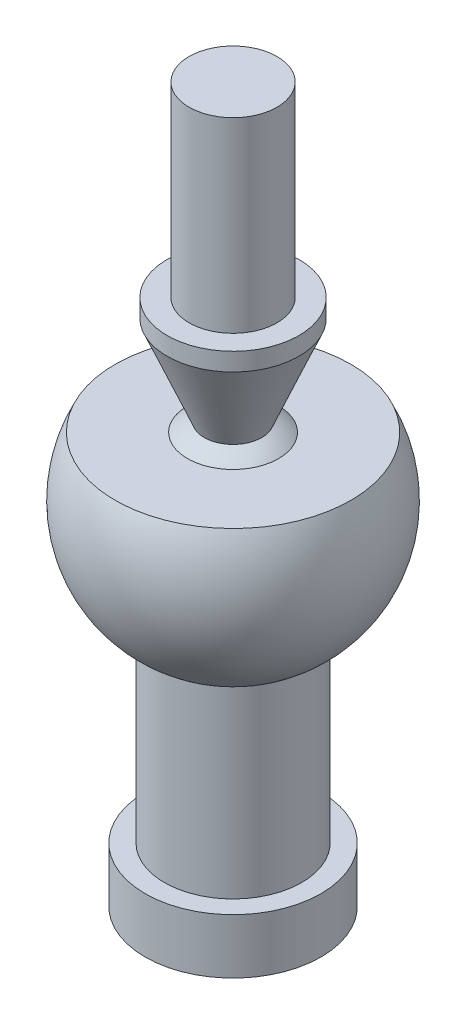
ISO-10303-21;
HEADER;
FILE_DESCRIPTION(('STEP AP214'),'2;1');
FILE_NAME('part.step','',(''),(''),'','','');
FILE_SCHEMA(('AUTOMOTIVE_DESIGN { 1 0 10303 214 1 1 1 1 }'));
ENDSEC;
DATA;
#1=APPLICATION_CONTEXT('core data for automotive mechanical design processes');
#2=APPLICATION_PROTOCOL_DEFINITION('international standard','automotive_design',2000,#1);
#3=PRODUCT_CONTEXT('',#1,'mechanical');
#4=PRODUCT('Part','Part','',(#3));
#5=PRODUCT_RELATED_PRODUCT_CATEGORY('part','',(#4));
#6=PRODUCT_DEFINITION_FORMATION('','',#4);
#7=PRODUCT_DEFINITION_CONTEXT('part definition',#1,'design');
#8=PRODUCT_DEFINITION('design','',#6,#7);
#9=PRODUCT_DEFINITION_SHAPE('','',#8);
#10=(LENGTH_UNIT() NAMED_UNIT(*) SI_UNIT(.MILLI.,.METRE.));
#11=(NAMED_UNIT(*) PLANE_ANGLE_UNIT() SI_UNIT($,.RADIAN.));
#12=(NAMED_UNIT(*) SI_UNIT($,.STERADIAN.) SOLID_ANGLE_UNIT());
#13=UNCERTAINTY_MEASURE_WITH_UNIT(LENGTH_MEASURE(1.E-05),#10,'distance_accuracy_value','');
#14=(GEOMETRIC_REPRESENTATION_CONTEXT(3) GLOBAL_UNCERTAINTY_ASSIGNED_CONTEXT((#13)) GLOBAL_UNIT_ASSIGNED_CONTEXT((#10,
#11,#12)) REPRESENTATION_CONTEXT('',''));
#15=CARTESIAN_POINT('',(0.,0.,0.));
#16=DIRECTION('',(0.,0.,1.));
#17=DIRECTION('',(1.,0.,0.));
#18=AXIS2_PLACEMENT_3D('',#15,#16,#17);
#19=CARTESIAN_POINT('',(0.,12.0381276017463,0.));
#20=DIRECTION('',(0.,-1.,0.));
#21=DIRECTION('',(0.,0.,-1.));
#22=AXIS2_PLACEMENT_3D('',#19,#20,#21);
#23=CONICAL_SURFACE('',#22,0.,1.04719755119659);
#24=CARTESIAN_POINT('',(0.,9.72872652498777,0.));
#25=DIRECTION('',(0.,-1.,0.));
#26=DIRECTION('',(0.,0.,-1.));
#27=AXIS2_PLACEMENT_3D('',#24,#25,#26);
#28=CIRCLE('',#27,4.);
#29=CARTESIAN_POINT('',(0.,9.72872652498777,-4.));
#30=VERTEX_POINT('',#29);
#31=EDGE_CURVE('E11',#30,#30,#28,.T.);
#32=ORIENTED_EDGE('',*,*,#31,.T.);
#33=EDGE_LOOP('',(#32));
#34=FACE_BOUND('',#33,.T.);
#35=CARTESIAN_POINT('',(0.,12.0381276017463,0.));
#36=VERTEX_POINT('',#35);
#37=VERTEX_LOOP('',#36);
#38=FACE_BOUND('',#37,.T.);
#39=ADVANCED_FACE('F34',(#34,#38),#23,.F.);
#40=CARTESIAN_POINT('',(0.,0.112242194172495,0.));
#41=DIRECTION('',(0.,-1.,0.));
#42=DIRECTION('',(0.,0.,-1.));
#43=AXIS2_PLACEMENT_3D('',#40,#41,#42);
#44=CYLINDRICAL_SURFACE('',#43,4.);
#45=CARTESIAN_POINT('',(0.,0.,0.));
#46=DIRECTION('',(0.,-1.,0.));
#47=DIRECTION('',(0.,0.,-1.));
#48=AXIS2_PLACEMENT_3D('',#45,#46,#47);
#49=CIRCLE('',#48,4.);
#50=CARTESIAN_POINT('',(0.,0.,-4.));
#51=VERTEX_POINT('',#50);
#52=EDGE_CURVE('E40',#51,#51,#49,.T.);
#53=ORIENTED_EDGE('',*,*,#52,.T.);
#54=EDGE_LOOP('',(#53));
#55=FACE_BOUND('',#54,.T.);
#56=ORIENTED_EDGE('',*,*,#31,.F.);
#57=EDGE_LOOP('',(#56));
#58=FACE_BOUND('',#57,.T.);
#59=ADVANCED_FACE('F44',(#55,#58),#44,.F.);
#60=CARTESIAN_POINT('',(4.,0.,0.));
#61=DIRECTION('',(0.,-1.,0.));
#62=DIRECTION('',(0.,0.,-1.));
#63=AXIS2_PLACEMENT_3D('',#60,#61,#62);
#64=PLANE('',#63);
#65=CARTESIAN_POINT('',(0.,0.,0.));
#66=DIRECTION('',(0.,-1.,0.));
#67=DIRECTION('',(0.,0.,-1.));
#68=AXIS2_PLACEMENT_3D('',#65,#66,#67);
#69=CIRCLE('',#68,8.);
#70=CARTESIAN_POINT('',(0.,0.,-8.));
#71=VERTEX_POINT('',#70);
#72=EDGE_CURVE('E137',#71,#71,#69,.T.);
#73=ORIENTED_EDGE('',*,*,#72,.T.);
#74=EDGE_LOOP('',(#73));
#75=FACE_BOUND('',#74,.T.);
#76=ORIENTED_EDGE('',*,*,#52,.F.);
#77=EDGE_LOOP('',(#76));
#78=FACE_BOUND('',#77,.T.);
#79=ADVANCED_FACE('F49',(#75,#78),#64,.T.);
#80=CARTESIAN_POINT('',(0.,0.112242194172495,0.));
#81=DIRECTION('',(0.,-1.,0.));
#82=DIRECTION('',(0.,0.,-1.));
#83=AXIS2_PLACEMENT_3D('',#80,#81,#82);
#84=CYLINDRICAL_SURFACE('',#83,8.);
#85=CARTESIAN_POINT('',(0.,5.,0.));
#86=DIRECTION('',(0.,-1.,0.));
#87=DIRECTION('',(0.,0.,-1.));
#88=AXIS2_PLACEMENT_3D('',#85,#86,#87);
#89=CIRCLE('',#88,8.);
#90=CARTESIAN_POINT('',(0.,5.,-8.));
#91=VERTEX_POINT('',#90);
#92=EDGE_CURVE('E134',#91,#91,#89,.T.);
#93=ORIENTED_EDGE('',*,*,#92,.T.);
#94=EDGE_LOOP('',(#93));
#95=FACE_BOUND('',#94,.T.);
#96=ORIENTED_EDGE('',*,*,#72,.F.);
#97=EDGE_LOOP('',(#96));
#98=FACE_BOUND('',#97,.T.);
#99=ADVANCED_FACE('F56',(#95,#98),#84,.T.);
#100=CARTESIAN_POINT('',(8.,5.,0.));
#101=DIRECTION('',(0.,1.,0.));
#102=DIRECTION('',(0.,0.,1.));
#103=AXIS2_PLACEMENT_3D('',#100,#101,#102);
#104=PLANE('',#103);
#105=CARTESIAN_POINT('',(0.,5.,0.));
#106=DIRECTION('',(0.,-1.,0.));
#107=DIRECTION('',(0.,0.,-1.));
#108=AXIS2_PLACEMENT_3D('',#105,#106,#107);
#109=CIRCLE('',#108,6.25);
#110=CARTESIAN_POINT('',(0.,5.,-6.25));
#111=VERTEX_POINT('',#110);
#112=EDGE_CURVE('E131',#111,#111,#109,.T.);
#113=ORIENTED_EDGE('',*,*,#112,.T.);
#114=EDGE_LOOP('',(#113));
#115=FACE_BOUND('',#114,.T.);
#116=ORIENTED_EDGE('',*,*,#92,.F.);
#117=EDGE_LOOP('',(#116));
#118=FACE_BOUND('',#117,.T.);
#119=ADVANCED_FACE('F63',(#115,#118),#104,.T.);
#120=CARTESIAN_POINT('',(0.,0.112242194172495,0.));
#121=DIRECTION('',(0.,-1.,0.));
#122=DIRECTION('',(0.,0.,-1.));
#123=AXIS2_PLACEMENT_3D('',#120,#121,#122);
#124=CYLINDRICAL_SURFACE('',#123,6.25);
#125=CARTESIAN_POINT('',(0.,21.7560993757261,0.));
#126=DIRECTION('',(0.,-1.,0.));
#127=DIRECTION('',(0.,0.,-1.));
#128=AXIS2_PLACEMENT_3D('',#125,#126,#127);
#129=CIRCLE('',#128,6.25);
#130=CARTESIAN_POINT('',(0.,21.7560993757261,-6.25));
#131=VERTEX_POINT('',#130);
#132=EDGE_CURVE('E128',#131,#131,#129,.T.);
#133=ORIENTED_EDGE('',*,*,#132,.T.);
#134=EDGE_LOOP('',(#133));
#135=FACE_BOUND('',#134,.T.);
#136=ORIENTED_EDGE('',*,*,#112,.F.);
#137=EDGE_LOOP('',(#136));
#138=FACE_BOUND('',#137,.T.);
#139=ADVANCED_FACE('F67',(#135,#138),#124,.T.);
#140=CARTESIAN_POINT('',(0.,32.,0.));
#141=DIRECTION('',(0.,-1.,0.));
#142=DIRECTION('',(1.,0.,0.));
#143=AXIS2_PLACEMENT_3D('',#140,#141,#142);
#144=SPHERICAL_SURFACE('',#143,12.);
#145=CARTESIAN_POINT('',(0.,37.3737921438134,0.));
#146=DIRECTION('',(0.,-1.,0.));
#147=DIRECTION('',(0.,0.,-1.));
#148=AXIS2_PLACEMENT_3D('',#145,#146,#147);
#149=CIRCLE('',#148,10.7295087490103);
#150=CARTESIAN_POINT('',(0.,37.3737921438134,-10.7295087490103));
#151=VERTEX_POINT('',#150);
#152=EDGE_CURVE('E125',#151,#151,#149,.T.);
#153=ORIENTED_EDGE('',*,*,#152,.T.);
#154=EDGE_LOOP('',(#153));
#155=FACE_BOUND('',#154,.T.);
#156=ORIENTED_EDGE('',*,*,#132,.F.);
#157=EDGE_LOOP('',(#156));
#158=FACE_BOUND('',#157,.T.);
#159=ADVANCED_FACE('F71',(#155,#158),#144,.T.);
#160=CARTESIAN_POINT('',(4.14914812003898,37.3737921438134,0.));
#161=DIRECTION('',(0.,1.,0.));
#162=DIRECTION('',(0.,0.,1.));
#163=AXIS2_PLACEMENT_3D('',#160,#161,#162);
#164=PLANE('',#163);
#165=CARTESIAN_POINT('',(0.,37.3737921438134,0.));
#166=DIRECTION('',(0.,-1.,0.));
#167=DIRECTION('',(0.,0.,-1.));
#168=AXIS2_PLACEMENT_3D('',#165,#166,#167);
#169=CIRCLE('',#168,4.14914812003898);
#170=CARTESIAN_POINT('',(0.,37.3737921438134,-4.14914812003898));
#171=VERTEX_POINT('',#170);
#172=EDGE_CURVE('E122',#171,#171,#169,.T.);
#173=ORIENTED_EDGE('',*,*,#172,.T.);
#174=EDGE_LOOP('',(#173));
#175=FACE_BOUND('',#174,.T.);
#176=ORIENTED_EDGE('',*,*,#152,.F.);
#177=EDGE_LOOP('',(#176));
#178=FACE_BOUND('',#177,.T.);
#179=ADVANCED_FACE('F75',(#175,#178),#164,.T.);
#180=CARTESIAN_POINT('',(0.,32.,0.));
#181=DIRECTION('',(0.,-1.,0.));
#182=DIRECTION('',(1.,0.,0.));
#183=AXIS2_PLACEMENT_3D('',#180,#181,#182);
#184=SPHERICAL_SURFACE('',#183,6.78918788419745);
#185=CARTESIAN_POINT('',(0.,38.264563171236,0.));
#186=DIRECTION('',(0.,-1.,0.));
#187=DIRECTION('',(0.,0.,-1.));
#188=AXIS2_PLACEMENT_3D('',#185,#186,#187);
#189=CIRCLE('',#188,2.61692957500322);
#190=CARTESIAN_POINT('',(0.,38.264563171236,-2.61692957500322));
#191=VERTEX_POINT('',#190);
#192=EDGE_CURVE('E119',#191,#191,#189,.T.);
#193=ORIENTED_EDGE('',*,*,#192,.T.);
#194=EDGE_LOOP('',(#193));
#195=FACE_BOUND('',#194,.T.);
#196=ORIENTED_EDGE('',*,*,#172,.F.);
#197=EDGE_LOOP('',(#196));
#198=FACE_BOUND('',#197,.T.);
#199=ADVANCED_FACE('F79',(#195,#198),#184,.T.);
#200=CARTESIAN_POINT('',(0.,38.264563171236,0.));
#201=DIRECTION('',(0.,1.,0.));
#202=DIRECTION('',(0.,0.,1.));
#203=AXIS2_PLACEMENT_3D('',#200,#201,#202);
#204=CONICAL_SURFACE('',#203,2.61692957500322,0.395701379867764);
#205=CARTESIAN_POINT('',(0.,46.3631603182787,0.));
#206=DIRECTION('',(0.,-1.,0.));
#207=DIRECTION('',(0.,0.,-1.));
#208=AXIS2_PLACEMENT_3D('',#205,#206,#207);
#209=CIRCLE('',#208,6.);
#210=CARTESIAN_POINT('',(0.,46.3631603182787,-6.));
#211=VERTEX_POINT('',#210);
#212=EDGE_CURVE('E116',#211,#211,#209,.T.);
#213=ORIENTED_EDGE('',*,*,#212,.T.);
#214=EDGE_LOOP('',(#213));
#215=FACE_BOUND('',#214,.T.);
#216=ORIENTED_EDGE('',*,*,#192,.F.);
#217=EDGE_LOOP('',(#216));
#218=FACE_BOUND('',#217,.T.);
#219=ADVANCED_FACE('F83',(#215,#218),#204,.T.);
#220=CARTESIAN_POINT('',(0.,0.112242194172495,0.));
#221=DIRECTION('',(0.,-1.,0.));
#222=DIRECTION('',(0.,0.,-1.));
#223=AXIS2_PLACEMENT_3D('',#220,#221,#222);
#224=CYLINDRICAL_SURFACE('',#223,6.);
#225=CARTESIAN_POINT('',(0.,48.,0.));
#226=DIRECTION('',(0.,-1.,0.));
#227=DIRECTION('',(0.,0.,-1.));
#228=AXIS2_PLACEMENT_3D('',#225,#226,#227);
#229=CIRCLE('',#228,6.);
#230=CARTESIAN_POINT('',(0.,48.,-6.));
#231=VERTEX_POINT('',#230);
#232=EDGE_CURVE('E111',#231,#231,#229,.T.);
#233=ORIENTED_EDGE('',*,*,#232,.T.);
#234=EDGE_LOOP('',(#233));
#235=FACE_BOUND('',#234,.T.);
#236=ORIENTED_EDGE('',*,*,#212,.F.);
#237=EDGE_LOOP('',(#236));
#238=FACE_BOUND('',#237,.T.);
#239=ADVANCED_FACE('F87',(#235,#238),#224,.T.);
#240=CARTESIAN_POINT('',(6.,48.,0.));
#241=DIRECTION('',(0.,1.,0.));
#242=DIRECTION('',(0.,0.,1.));
#243=AXIS2_PLACEMENT_3D('',#240,#241,#242);
#244=PLANE('',#243);
#245=CARTESIAN_POINT('',(0.,48.,0.));
#246=DIRECTION('',(0.,-1.,0.));
#247=DIRECTION('',(0.,0.,-1.));
#248=AXIS2_PLACEMENT_3D('',#245,#246,#247);
#249=CIRCLE('',#248,4.);
#250=CARTESIAN_POINT('',(0.,48.,-4.));
#251=VERTEX_POINT('',#250);
#252=EDGE_CURVE('E108',#251,#251,#249,.T.);
#253=ORIENTED_EDGE('',*,*,#252,.T.);
#254=EDGE_LOOP('',(#253));
#255=FACE_BOUND('',#254,.T.);
#256=ORIENTED_EDGE('',*,*,#232,.F.);
#257=EDGE_LOOP('',(#256));
#258=FACE_BOUND('',#257,.T.);
#259=ADVANCED_FACE('F91',(#255,#258),#244,.T.);
#260=CARTESIAN_POINT('',(0.,0.112242194172495,0.));
#261=DIRECTION('',(0.,-1.,0.));
#262=DIRECTION('',(0.,0.,-1.));
#263=AXIS2_PLACEMENT_3D('',#260,#261,#262);
#264=CYLINDRICAL_SURFACE('',#263,4.);
#265=CARTESIAN_POINT('',(0.,65.,0.));
#266=DIRECTION('',(0.,-1.,0.));
#267=DIRECTION('',(0.,0.,-1.));
#268=AXIS2_PLACEMENT_3D('',#265,#266,#267);
#269=CIRCLE('',#268,4.);
#270=CARTESIAN_POINT('',(0.,65.,-4.));
#271=VERTEX_POINT('',#270);
#272=EDGE_CURVE('E107',#271,#271,#269,.T.);
#273=ORIENTED_EDGE('',*,*,#272,.T.);
#274=EDGE_LOOP('',(#273));
#275=FACE_BOUND('',#274,.T.);
#276=ORIENTED_EDGE('',*,*,#252,.F.);
#277=EDGE_LOOP('',(#276));
#278=FACE_BOUND('',#277,.T.);
#279=ADVANCED_FACE('F95',(#275,#278),#264,.T.);
#280=CARTESIAN_POINT('',(4.,65.,0.));
#281=DIRECTION('',(0.,1.,0.));
#282=DIRECTION('',(0.,0.,1.));
#283=AXIS2_PLACEMENT_3D('',#280,#281,#282);
#284=PLANE('',#283);
#285=ORIENTED_EDGE('',*,*,#272,.F.);
#286=EDGE_LOOP('',(#285));
#287=FACE_BOUND('',#286,.T.);
#288=ADVANCED_FACE('F99',(#287),#284,.T.);
#289=CLOSED_SHELL('',(#39,#59,#79,#99,#119,#139,#159,#179,#199,#219,#239,#259,#279,#288));
#290=MANIFOLD_SOLID_BREP('B2',#289);
#291=ADVANCED_BREP_SHAPE_REPRESENTATION('',(#18,#290),#14);
#292=SHAPE_DEFINITION_REPRESENTATION(#9,#291);
ENDSEC;
END-ISO-10303-21;
